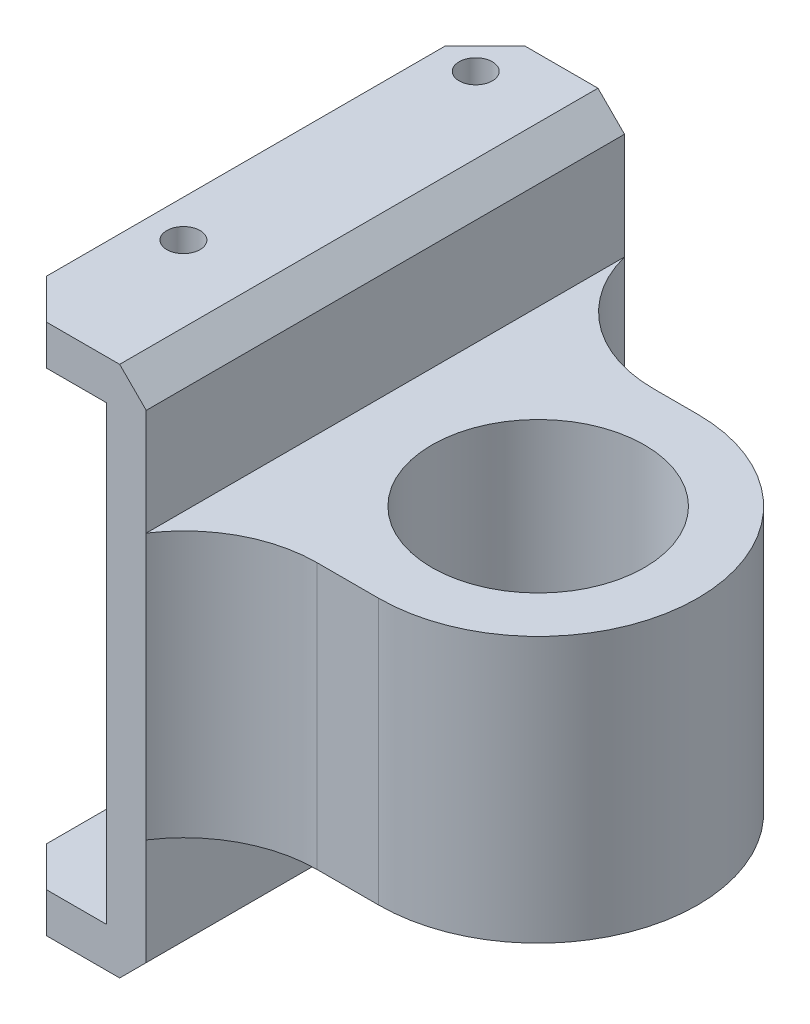
ISO-10303-21;
HEADER;
FILE_DESCRIPTION(('STEP AP214'),'2;1');
FILE_NAME('part.step','',(''),(''),'','','');
FILE_SCHEMA(('AUTOMOTIVE_DESIGN { 1 0 10303 214 1 1 1 1 }'));
ENDSEC;
DATA;
#1=APPLICATION_CONTEXT('core data for automotive mechanical design processes');
#2=APPLICATION_PROTOCOL_DEFINITION('international standard','automotive_design',2000,#1);
#3=PRODUCT_CONTEXT('',#1,'mechanical');
#4=PRODUCT('Part','Part','',(#3));
#5=PRODUCT_RELATED_PRODUCT_CATEGORY('part','',(#4));
#6=PRODUCT_DEFINITION_FORMATION('','',#4);
#7=PRODUCT_DEFINITION_CONTEXT('part definition',#1,'design');
#8=PRODUCT_DEFINITION('design','',#6,#7);
#9=PRODUCT_DEFINITION_SHAPE('','',#8);
#10=(LENGTH_UNIT() NAMED_UNIT(*) SI_UNIT(.MILLI.,.METRE.));
#11=(NAMED_UNIT(*) PLANE_ANGLE_UNIT() SI_UNIT($,.RADIAN.));
#12=(NAMED_UNIT(*) SI_UNIT($,.STERADIAN.) SOLID_ANGLE_UNIT());
#13=UNCERTAINTY_MEASURE_WITH_UNIT(LENGTH_MEASURE(1.E-05),#10,'distance_accuracy_value','');
#14=(GEOMETRIC_REPRESENTATION_CONTEXT(3) GLOBAL_UNCERTAINTY_ASSIGNED_CONTEXT((#13)) GLOBAL_UNIT_ASSIGNED_CONTEXT((#10,
#11,#12)) REPRESENTATION_CONTEXT('',''));
#15=CARTESIAN_POINT('',(0.,0.,0.));
#16=DIRECTION('',(0.,0.,1.));
#17=DIRECTION('',(1.,0.,0.));
#18=AXIS2_PLACEMENT_3D('',#15,#16,#17);
#19=CARTESIAN_POINT('',(-10.5,20.,36.));
#20=DIRECTION('',(1.,0.,0.));
#21=DIRECTION('',(0.,0.,-1.));
#22=AXIS2_PLACEMENT_3D('',#19,#20,#21);
#23=PLANE('',#22);
#24=DIRECTION('',(0.,0.,-1.));
#25=VECTOR('',#24,1.);
#26=CARTESIAN_POINT('',(-10.5,17.,36.));
#27=LINE('',#26,#25);
#28=CARTESIAN_POINT('',(-10.5,17.,33.));
#29=VERTEX_POINT('',#28);
#30=CARTESIAN_POINT('',(-10.5,17.,3.00000000000001));
#31=VERTEX_POINT('',#30);
#32=EDGE_CURVE('E229',#29,#31,#27,.T.);
#33=ORIENTED_EDGE('',*,*,#32,.F.);
#34=DIRECTION('',(0.,1.,0.));
#35=VECTOR('',#34,1.);
#36=CARTESIAN_POINT('',(-10.5,20.,33.));
#37=LINE('',#36,#35);
#38=CARTESIAN_POINT('',(-10.5,20.,33.));
#39=VERTEX_POINT('',#38);
#40=EDGE_CURVE('E263',#29,#39,#37,.T.);
#41=ORIENTED_EDGE('',*,*,#40,.T.);
#42=DIRECTION('',(0.,0.,-1.));
#43=VECTOR('',#42,1.);
#44=CARTESIAN_POINT('',(-10.5,20.,36.));
#45=LINE('',#44,#43);
#46=CARTESIAN_POINT('',(-10.5,20.,3.00000000000001));
#47=VERTEX_POINT('',#46);
#48=EDGE_CURVE('E213',#39,#47,#45,.T.);
#49=ORIENTED_EDGE('',*,*,#48,.T.);
#50=DIRECTION('',(0.,-1.,0.));
#51=VECTOR('',#50,1.);
#52=CARTESIAN_POINT('',(-10.5,20.,3.));
#53=LINE('',#52,#51);
#54=EDGE_CURVE('E260',#47,#31,#53,.T.);
#55=ORIENTED_EDGE('',*,*,#54,.T.);
#56=EDGE_LOOP('',(#33,#41,#49,#55));
#57=FACE_BOUND('',#56,.T.);
#58=ADVANCED_FACE('F32',(#57),#23,.F.);
#59=CARTESIAN_POINT('',(-10.5,17.,36.));
#60=DIRECTION('',(0.,1.,0.));
#61=DIRECTION('',(0.,0.,1.));
#62=AXIS2_PLACEMENT_3D('',#59,#60,#61);
#63=PLANE('',#62);
#64=CARTESIAN_POINT('',(-7.69999999999999,17.,25.5));
#65=DIRECTION('',(0.,1.,0.));
#66=DIRECTION('',(0.,0.,1.));
#67=AXIS2_PLACEMENT_3D('',#64,#65,#66);
#68=CIRCLE('',#67,1.25);
#69=CARTESIAN_POINT('',(-7.69999999999999,17.,26.75));
#70=VERTEX_POINT('',#69);
#71=EDGE_CURVE('E336',#70,#70,#68,.T.);
#72=ORIENTED_EDGE('',*,*,#71,.T.);
#73=EDGE_LOOP('',(#72));
#74=FACE_BOUND('',#73,.T.);
#75=CARTESIAN_POINT('',(-7.7,17.,3.5));
#76=DIRECTION('',(0.,1.,0.));
#77=DIRECTION('',(0.,0.,1.));
#78=AXIS2_PLACEMENT_3D('',#75,#76,#77);
#79=CIRCLE('',#78,1.25);
#80=CARTESIAN_POINT('',(-7.7,17.,4.75));
#81=VERTEX_POINT('',#80);
#82=EDGE_CURVE('E348',#81,#81,#79,.T.);
#83=ORIENTED_EDGE('',*,*,#82,.T.);
#84=EDGE_LOOP('',(#83));
#85=FACE_BOUND('',#84,.T.);
#86=DIRECTION('',(1.,0.,0.));
#87=VECTOR('',#86,1.);
#88=CARTESIAN_POINT('',(-10.5,17.,36.));
#89=LINE('',#88,#87);
#90=CARTESIAN_POINT('',(-7.49999999999999,17.,36.));
#91=VERTEX_POINT('',#90);
#92=CARTESIAN_POINT('',(-3.,17.,36.));
#93=VERTEX_POINT('',#92);
#94=EDGE_CURVE('E212',#91,#93,#89,.T.);
#95=ORIENTED_EDGE('',*,*,#94,.F.);
#96=DIRECTION('',(-0.707106781186546,0.,-0.707106781186549));
#97=VECTOR('',#96,1.);
#98=CARTESIAN_POINT('',(-7.49999999999999,17.,36.));
#99=LINE('',#98,#97);
#100=EDGE_CURVE('E258',#91,#29,#99,.T.);
#101=ORIENTED_EDGE('',*,*,#100,.T.);
#102=ORIENTED_EDGE('',*,*,#32,.T.);
#103=DIRECTION('',(-0.707106781186548,0.,0.707106781186547));
#104=VECTOR('',#103,1.);
#105=CARTESIAN_POINT('',(-10.5,17.,3.));
#106=LINE('',#105,#104);
#107=CARTESIAN_POINT('',(-7.49999999999999,17.,0.));
#108=VERTEX_POINT('',#107);
#109=EDGE_CURVE('E256',#31,#108,#106,.F.);
#110=ORIENTED_EDGE('',*,*,#109,.T.);
#111=DIRECTION('',(1.,0.,0.));
#112=VECTOR('',#111,1.);
#113=CARTESIAN_POINT('',(-10.5,17.,0.));
#114=LINE('',#113,#112);
#115=CARTESIAN_POINT('',(-3.,17.,0.));
#116=VERTEX_POINT('',#115);
#117=EDGE_CURVE('E351',#108,#116,#114,.T.);
#118=ORIENTED_EDGE('',*,*,#117,.T.);
#119=DIRECTION('',(0.,0.,-1.));
#120=VECTOR('',#119,1.);
#121=CARTESIAN_POINT('',(-3.,17.,36.));
#122=LINE('',#121,#120);
#123=EDGE_CURVE('E226',#93,#116,#122,.T.);
#124=ORIENTED_EDGE('',*,*,#123,.F.);
#125=EDGE_LOOP('',(#95,#101,#102,#110,#118,#124));
#126=FACE_BOUND('',#125,.T.);
#127=ADVANCED_FACE('F418',(#74,#85,#126),#63,.F.);
#128=CARTESIAN_POINT('',(-3.,17.,36.));
#129=DIRECTION('',(1.,0.,0.));
#130=DIRECTION('',(0.,1.,0.));
#131=AXIS2_PLACEMENT_3D('',#128,#129,#130);
#132=PLANE('',#131);
#133=DIRECTION('',(0.,-1.,0.));
#134=VECTOR('',#133,1.);
#135=CARTESIAN_POINT('',(-3.,17.,0.));
#136=LINE('',#135,#134);
#137=CARTESIAN_POINT('',(-2.99999999999999,-17.,0.));
#138=VERTEX_POINT('',#137);
#139=EDGE_CURVE('E364',#116,#138,#136,.T.);
#140=ORIENTED_EDGE('',*,*,#139,.T.);
#141=DIRECTION('',(0.,0.,-1.));
#142=VECTOR('',#141,1.);
#143=CARTESIAN_POINT('',(-2.99999999999999,-17.,36.));
#144=LINE('',#143,#142);
#145=CARTESIAN_POINT('',(-2.99999999999999,-17.,36.));
#146=VERTEX_POINT('',#145);
#147=EDGE_CURVE('E223',#146,#138,#144,.T.);
#148=ORIENTED_EDGE('',*,*,#147,.F.);
#149=DIRECTION('',(0.,-1.,0.));
#150=VECTOR('',#149,1.);
#151=CARTESIAN_POINT('',(-3.,17.,36.));
#152=LINE('',#151,#150);
#153=EDGE_CURVE('E353',#93,#146,#152,.T.);
#154=ORIENTED_EDGE('',*,*,#153,.F.);
#155=ORIENTED_EDGE('',*,*,#123,.T.);
#156=EDGE_LOOP('',(#140,#148,#154,#155));
#157=FACE_BOUND('',#156,.T.);
#158=ADVANCED_FACE('F394',(#157),#132,.F.);
#159=CARTESIAN_POINT('',(-10.5,-17.,36.));
#160=DIRECTION('',(0.,-1.,0.));
#161=DIRECTION('',(0.,0.,-1.));
#162=AXIS2_PLACEMENT_3D('',#159,#160,#161);
#163=PLANE('',#162);
#164=CARTESIAN_POINT('',(-7.69999999999999,-17.,25.5));
#165=DIRECTION('',(0.,-1.,0.));
#166=DIRECTION('',(0.,0.,-1.));
#167=AXIS2_PLACEMENT_3D('',#164,#165,#166);
#168=CIRCLE('',#167,1.25);
#169=CARTESIAN_POINT('',(-7.69999999999999,-17.,24.25));
#170=VERTEX_POINT('',#169);
#171=EDGE_CURVE('E331',#170,#170,#168,.T.);
#172=ORIENTED_EDGE('',*,*,#171,.T.);
#173=EDGE_LOOP('',(#172));
#174=FACE_BOUND('',#173,.T.);
#175=CARTESIAN_POINT('',(-7.7,-17.,3.5));
#176=DIRECTION('',(0.,-1.,0.));
#177=DIRECTION('',(0.,0.,-1.));
#178=AXIS2_PLACEMENT_3D('',#175,#176,#177);
#179=CIRCLE('',#178,1.25);
#180=CARTESIAN_POINT('',(-7.7,-17.,2.25));
#181=VERTEX_POINT('',#180);
#182=EDGE_CURVE('E343',#181,#181,#179,.T.);
#183=ORIENTED_EDGE('',*,*,#182,.T.);
#184=EDGE_LOOP('',(#183));
#185=FACE_BOUND('',#184,.T.);
#186=DIRECTION('',(0.,0.,-1.));
#187=VECTOR('',#186,1.);
#188=CARTESIAN_POINT('',(-10.5,-17.,36.));
#189=LINE('',#188,#187);
#190=CARTESIAN_POINT('',(-10.5,-17.,33.));
#191=VERTEX_POINT('',#190);
#192=CARTESIAN_POINT('',(-10.5,-17.,3.00000000000001));
#193=VERTEX_POINT('',#192);
#194=EDGE_CURVE('E220',#191,#193,#189,.T.);
#195=ORIENTED_EDGE('',*,*,#194,.F.);
#196=DIRECTION('',(0.707106781186546,0.,0.707106781186549));
#197=VECTOR('',#196,1.);
#198=CARTESIAN_POINT('',(-7.49999999999999,-17.,36.));
#199=LINE('',#198,#197);
#200=CARTESIAN_POINT('',(-7.49999999999999,-17.,36.));
#201=VERTEX_POINT('',#200);
#202=EDGE_CURVE('E249',#191,#201,#199,.T.);
#203=ORIENTED_EDGE('',*,*,#202,.T.);
#204=DIRECTION('',(-1.,0.,0.));
#205=VECTOR('',#204,1.);
#206=CARTESIAN_POINT('',(-10.5,-17.,36.));
#207=LINE('',#206,#205);
#208=EDGE_CURVE('E355',#146,#201,#207,.T.);
#209=ORIENTED_EDGE('',*,*,#208,.F.);
#210=ORIENTED_EDGE('',*,*,#147,.T.);
#211=DIRECTION('',(-1.,0.,0.));
#212=VECTOR('',#211,1.);
#213=CARTESIAN_POINT('',(-10.5,-17.,0.));
#214=LINE('',#213,#212);
#215=CARTESIAN_POINT('',(-7.49999999999999,-17.,0.));
#216=VERTEX_POINT('',#215);
#217=EDGE_CURVE('E207',#138,#216,#214,.T.);
#218=ORIENTED_EDGE('',*,*,#217,.T.);
#219=DIRECTION('',(0.707106781186548,0.,-0.707106781186547));
#220=VECTOR('',#219,1.);
#221=CARTESIAN_POINT('',(-10.5,-17.,3.));
#222=LINE('',#221,#220);
#223=EDGE_CURVE('E247',#216,#193,#222,.F.);
#224=ORIENTED_EDGE('',*,*,#223,.T.);
#225=EDGE_LOOP('',(#195,#203,#209,#210,#218,#224));
#226=FACE_BOUND('',#225,.T.);
#227=ADVANCED_FACE('F370',(#174,#185,#226),#163,.F.);
#228=CARTESIAN_POINT('',(-10.5,-17.,36.));
#229=DIRECTION('',(1.,0.,0.));
#230=DIRECTION('',(0.,0.,-1.));
#231=AXIS2_PLACEMENT_3D('',#228,#229,#230);
#232=PLANE('',#231);
#233=DIRECTION('',(0.,0.,-1.));
#234=VECTOR('',#233,1.);
#235=CARTESIAN_POINT('',(-10.5,-20.,36.));
#236=LINE('',#235,#234);
#237=CARTESIAN_POINT('',(-10.5,-20.,33.));
#238=VERTEX_POINT('',#237);
#239=CARTESIAN_POINT('',(-10.5,-20.,3.00000000000001));
#240=VERTEX_POINT('',#239);
#241=EDGE_CURVE('E216',#238,#240,#236,.T.);
#242=ORIENTED_EDGE('',*,*,#241,.F.);
#243=DIRECTION('',(0.,1.,0.));
#244=VECTOR('',#243,1.);
#245=CARTESIAN_POINT('',(-10.5,-17.,33.));
#246=LINE('',#245,#244);
#247=EDGE_CURVE('E245',#238,#191,#246,.T.);
#248=ORIENTED_EDGE('',*,*,#247,.T.);
#249=ORIENTED_EDGE('',*,*,#194,.T.);
#250=DIRECTION('',(0.,-1.,0.));
#251=VECTOR('',#250,1.);
#252=CARTESIAN_POINT('',(-10.5,-17.,3.));
#253=LINE('',#252,#251);
#254=EDGE_CURVE('E242',#193,#240,#253,.T.);
#255=ORIENTED_EDGE('',*,*,#254,.T.);
#256=EDGE_LOOP('',(#242,#248,#249,#255));
#257=FACE_BOUND('',#256,.T.);
#258=ADVANCED_FACE('F380',(#257),#232,.F.);
#259=CARTESIAN_POINT('',(-10.5,-20.,36.));
#260=DIRECTION('',(0.,1.,0.));
#261=DIRECTION('',(0.,0.,1.));
#262=AXIS2_PLACEMENT_3D('',#259,#260,#261);
#263=PLANE('',#262);
#264=CARTESIAN_POINT('',(-7.69999999999999,-20.,25.5));
#265=DIRECTION('',(0.,1.,0.));
#266=DIRECTION('',(0.,0.,1.));
#267=AXIS2_PLACEMENT_3D('',#264,#265,#266);
#268=CIRCLE('',#267,1.25);
#269=CARTESIAN_POINT('',(-7.69999999999999,-20.,26.75));
#270=VERTEX_POINT('',#269);
#271=EDGE_CURVE('E328',#270,#270,#268,.T.);
#272=ORIENTED_EDGE('',*,*,#271,.T.);
#273=EDGE_LOOP('',(#272));
#274=FACE_BOUND('',#273,.T.);
#275=CARTESIAN_POINT('',(-7.7,-20.,3.5));
#276=DIRECTION('',(0.,1.,0.));
#277=DIRECTION('',(0.,0.,1.));
#278=AXIS2_PLACEMENT_3D('',#275,#276,#277);
#279=CIRCLE('',#278,1.25);
#280=CARTESIAN_POINT('',(-7.7,-20.,4.75));
#281=VERTEX_POINT('',#280);
#282=EDGE_CURVE('E340',#281,#281,#279,.T.);
#283=ORIENTED_EDGE('',*,*,#282,.T.);
#284=EDGE_LOOP('',(#283));
#285=FACE_BOUND('',#284,.T.);
#286=DIRECTION('',(1.,0.,0.));
#287=VECTOR('',#286,1.);
#288=CARTESIAN_POINT('',(-10.5,-20.,0.));
#289=LINE('',#288,#287);
#290=CARTESIAN_POINT('',(-7.49999999999999,-20.,0.));
#291=VERTEX_POINT('',#290);
#292=CARTESIAN_POINT('',(-2.,-20.,0.));
#293=VERTEX_POINT('',#292);
#294=EDGE_CURVE('E205',#291,#293,#289,.T.);
#295=ORIENTED_EDGE('',*,*,#294,.T.);
#296=DIRECTION('',(0.,0.,1.));
#297=VECTOR('',#296,1.);
#298=CARTESIAN_POINT('',(-2.,-20.,36.));
#299=LINE('',#298,#297);
#300=CARTESIAN_POINT('',(-2.,-20.,36.));
#301=VERTEX_POINT('',#300);
#302=EDGE_CURVE('E278',#293,#301,#299,.T.);
#303=ORIENTED_EDGE('',*,*,#302,.T.);
#304=DIRECTION('',(1.,0.,0.));
#305=VECTOR('',#304,1.);
#306=CARTESIAN_POINT('',(-10.5,-20.,36.));
#307=LINE('',#306,#305);
#308=CARTESIAN_POINT('',(-7.49999999999999,-20.,36.));
#309=VERTEX_POINT('',#308);
#310=EDGE_CURVE('E358',#309,#301,#307,.T.);
#311=ORIENTED_EDGE('',*,*,#310,.F.);
#312=DIRECTION('',(-0.707106781186546,0.,-0.707106781186549));
#313=VECTOR('',#312,1.);
#314=CARTESIAN_POINT('',(-7.49999999999999,-20.,36.));
#315=LINE('',#314,#313);
#316=EDGE_CURVE('E240',#309,#238,#315,.T.);
#317=ORIENTED_EDGE('',*,*,#316,.T.);
#318=ORIENTED_EDGE('',*,*,#241,.T.);
#319=DIRECTION('',(-0.707106781186548,0.,0.707106781186547));
#320=VECTOR('',#319,1.);
#321=CARTESIAN_POINT('',(-10.5,-20.,3.));
#322=LINE('',#321,#320);
#323=EDGE_CURVE('E238',#240,#291,#322,.F.);
#324=ORIENTED_EDGE('',*,*,#323,.T.);
#325=EDGE_LOOP('',(#295,#303,#311,#317,#318,#324));
#326=FACE_BOUND('',#325,.T.);
#327=ADVANCED_FACE('F383',(#274,#285,#326),#263,.F.);
#328=CARTESIAN_POINT('',(-10.5,20.,36.));
#329=DIRECTION('',(0.,-1.,0.));
#330=DIRECTION('',(0.,0.,-1.));
#331=AXIS2_PLACEMENT_3D('',#328,#329,#330);
#332=PLANE('',#331);
#333=CARTESIAN_POINT('',(-7.69999999999999,20.,25.5));
#334=DIRECTION('',(0.,1.,0.));
#335=DIRECTION('',(0.,0.,1.));
#336=AXIS2_PLACEMENT_3D('',#333,#334,#335);
#337=CIRCLE('',#336,1.25);
#338=CARTESIAN_POINT('',(-7.69999999999999,20.,26.75));
#339=VERTEX_POINT('',#338);
#340=EDGE_CURVE('E326',#339,#339,#337,.T.);
#341=ORIENTED_EDGE('',*,*,#340,.F.);
#342=EDGE_LOOP('',(#341));
#343=FACE_BOUND('',#342,.T.);
#344=CARTESIAN_POINT('',(-7.7,20.,3.5));
#345=DIRECTION('',(0.,1.,0.));
#346=DIRECTION('',(0.,0.,1.));
#347=AXIS2_PLACEMENT_3D('',#344,#345,#346);
#348=CIRCLE('',#347,1.25);
#349=CARTESIAN_POINT('',(-7.7,20.,4.75));
#350=VERTEX_POINT('',#349);
#351=EDGE_CURVE('E339',#350,#350,#348,.T.);
#352=ORIENTED_EDGE('',*,*,#351,.F.);
#353=EDGE_LOOP('',(#352));
#354=FACE_BOUND('',#353,.T.);
#355=DIRECTION('',(-1.,0.,0.));
#356=VECTOR('',#355,1.);
#357=CARTESIAN_POINT('',(-10.5,20.,36.));
#358=LINE('',#357,#356);
#359=CARTESIAN_POINT('',(-2.00000000000001,20.,36.));
#360=VERTEX_POINT('',#359);
#361=CARTESIAN_POINT('',(-7.49999999999999,20.,36.));
#362=VERTEX_POINT('',#361);
#363=EDGE_CURVE('E217',#360,#362,#358,.T.);
#364=ORIENTED_EDGE('',*,*,#363,.F.);
#365=DIRECTION('',(0.,0.,-1.));
#366=VECTOR('',#365,1.);
#367=CARTESIAN_POINT('',(-2.00000000000001,20.,36.));
#368=LINE('',#367,#366);
#369=CARTESIAN_POINT('',(-2.00000000000001,20.,0.));
#370=VERTEX_POINT('',#369);
#371=EDGE_CURVE('E11',#360,#370,#368,.T.);
#372=ORIENTED_EDGE('',*,*,#371,.T.);
#373=DIRECTION('',(-1.,0.,0.));
#374=VECTOR('',#373,1.);
#375=CARTESIAN_POINT('',(-10.5,20.,0.));
#376=LINE('',#375,#374);
#377=CARTESIAN_POINT('',(-7.49999999999999,20.,0.));
#378=VERTEX_POINT('',#377);
#379=EDGE_CURVE('E178',#370,#378,#376,.T.);
#380=ORIENTED_EDGE('',*,*,#379,.T.);
#381=DIRECTION('',(0.707106781186548,0.,-0.707106781186547));
#382=VECTOR('',#381,1.);
#383=CARTESIAN_POINT('',(-10.5,20.,3.));
#384=LINE('',#383,#382);
#385=EDGE_CURVE('E265',#378,#47,#384,.F.);
#386=ORIENTED_EDGE('',*,*,#385,.T.);
#387=ORIENTED_EDGE('',*,*,#48,.F.);
#388=DIRECTION('',(0.707106781186546,0.,0.707106781186549));
#389=VECTOR('',#388,1.);
#390=CARTESIAN_POINT('',(-7.49999999999999,20.,36.));
#391=LINE('',#390,#389);
#392=EDGE_CURVE('E267',#39,#362,#391,.T.);
#393=ORIENTED_EDGE('',*,*,#392,.T.);
#394=EDGE_LOOP('',(#364,#372,#380,#386,#387,#393));
#395=FACE_BOUND('',#394,.T.);
#396=ADVANCED_FACE('F403',(#343,#354,#395),#332,.F.);
#397=CARTESIAN_POINT('',(0.,0.,36.));
#398=DIRECTION('',(0.,0.,1.));
#399=DIRECTION('',(1.,0.,0.));
#400=AXIS2_PLACEMENT_3D('',#397,#398,#399);
#401=PLANE('',#400);
#402=ORIENTED_EDGE('',*,*,#310,.T.);
#403=DIRECTION('',(-0.707106781186545,-0.70710678118655,0.));
#404=VECTOR('',#403,1.);
#405=CARTESIAN_POINT('',(8.99999999999999,-8.99999999999993,36.));
#406=LINE('',#405,#404);
#407=CARTESIAN_POINT('',(0.,-18.,36.));
#408=VERTEX_POINT('',#407);
#409=EDGE_CURVE('E283',#301,#408,#406,.F.);
#410=ORIENTED_EDGE('',*,*,#409,.T.);
#411=DIRECTION('',(0.,1.,0.));
#412=VECTOR('',#411,1.);
#413=CARTESIAN_POINT('',(0.,20.,36.));
#414=LINE('',#413,#412);
#415=CARTESIAN_POINT('',(0.,-10.,36.));
#416=VERTEX_POINT('',#415);
#417=EDGE_CURVE('E360',#408,#416,#414,.T.);
#418=ORIENTED_EDGE('',*,*,#417,.T.);
#419=CARTESIAN_POINT('',(0.,10.,36.));
#420=VERTEX_POINT('',#419);
#421=EDGE_CURVE('E300',#416,#420,#414,.T.);
#422=ORIENTED_EDGE('',*,*,#421,.T.);
#423=DIRECTION('',(0.,-1.,0.));
#424=VECTOR('',#423,1.);
#425=CARTESIAN_POINT('',(0.,20.,36.));
#426=LINE('',#425,#424);
#427=CARTESIAN_POINT('',(0.,18.,36.));
#428=VERTEX_POINT('',#427);
#429=EDGE_CURVE('E294',#428,#420,#426,.T.);
#430=ORIENTED_EDGE('',*,*,#429,.F.);
#431=DIRECTION('',(0.707106781186549,-0.707106781186546,0.));
#432=VECTOR('',#431,1.);
#433=CARTESIAN_POINT('',(9.,9.00000000000003,36.));
#434=LINE('',#433,#432);
#435=EDGE_CURVE('E281',#428,#360,#434,.F.);
#436=ORIENTED_EDGE('',*,*,#435,.T.);
#437=ORIENTED_EDGE('',*,*,#363,.T.);
#438=DIRECTION('',(0.,-1.,0.));
#439=VECTOR('',#438,1.);
#440=CARTESIAN_POINT('',(-7.49999999999999,17.,36.));
#441=LINE('',#440,#439);
#442=EDGE_CURVE('E232',#362,#91,#441,.T.);
#443=ORIENTED_EDGE('',*,*,#442,.T.);
#444=ORIENTED_EDGE('',*,*,#94,.T.);
#445=ORIENTED_EDGE('',*,*,#153,.T.);
#446=ORIENTED_EDGE('',*,*,#208,.T.);
#447=DIRECTION('',(0.,-1.,0.));
#448=VECTOR('',#447,1.);
#449=CARTESIAN_POINT('',(-7.49999999999999,-20.,36.));
#450=LINE('',#449,#448);
#451=EDGE_CURVE('E235',#201,#309,#450,.T.);
#452=ORIENTED_EDGE('',*,*,#451,.T.);
#453=EDGE_LOOP('',(#402,#410,#418,#422,#430,#436,#437,#443,#444,#445,#446,#452));
#454=FACE_BOUND('',#453,.T.);
#455=ADVANCED_FACE('F299',(#454),#401,.T.);
#456=CARTESIAN_POINT('',(0.,0.,0.));
#457=DIRECTION('',(0.,0.,1.));
#458=DIRECTION('',(1.,0.,0.));
#459=AXIS2_PLACEMENT_3D('',#456,#457,#458);
#460=PLANE('',#459);
#461=DIRECTION('',(0.,1.,0.));
#462=VECTOR('',#461,1.);
#463=CARTESIAN_POINT('',(0.,20.,0.));
#464=LINE('',#463,#462);
#465=CARTESIAN_POINT('',(0.,-18.,0.));
#466=VERTEX_POINT('',#465);
#467=CARTESIAN_POINT('',(0.,-10.,0.));
#468=VERTEX_POINT('',#467);
#469=EDGE_CURVE('E168',#466,#468,#464,.T.);
#470=ORIENTED_EDGE('',*,*,#469,.F.);
#471=DIRECTION('',(0.707106781186545,0.70710678118655,0.));
#472=VECTOR('',#471,1.);
#473=CARTESIAN_POINT('',(-2.,-20.,0.));
#474=LINE('',#473,#472);
#475=EDGE_CURVE('E287',#466,#293,#474,.F.);
#476=ORIENTED_EDGE('',*,*,#475,.T.);
#477=ORIENTED_EDGE('',*,*,#294,.F.);
#478=DIRECTION('',(0.,1.,0.));
#479=VECTOR('',#478,1.);
#480=CARTESIAN_POINT('',(-7.49999999999999,0.,0.));
#481=LINE('',#480,#479);
#482=EDGE_CURVE('E254',#291,#216,#481,.T.);
#483=ORIENTED_EDGE('',*,*,#482,.T.);
#484=ORIENTED_EDGE('',*,*,#217,.F.);
#485=ORIENTED_EDGE('',*,*,#139,.F.);
#486=ORIENTED_EDGE('',*,*,#117,.F.);
#487=DIRECTION('',(0.,1.,0.));
#488=VECTOR('',#487,1.);
#489=CARTESIAN_POINT('',(-7.49999999999999,0.,0.));
#490=LINE('',#489,#488);
#491=EDGE_CURVE('E251',#108,#378,#490,.T.);
#492=ORIENTED_EDGE('',*,*,#491,.T.);
#493=ORIENTED_EDGE('',*,*,#379,.F.);
#494=DIRECTION('',(-0.707106781186549,0.707106781186546,0.));
#495=VECTOR('',#494,1.);
#496=CARTESIAN_POINT('',(0.,18.,0.));
#497=LINE('',#496,#495);
#498=CARTESIAN_POINT('',(0.,18.,0.));
#499=VERTEX_POINT('',#498);
#500=EDGE_CURVE('E47',#370,#499,#497,.F.);
#501=ORIENTED_EDGE('',*,*,#500,.T.);
#502=DIRECTION('',(0.,-1.,0.));
#503=VECTOR('',#502,1.);
#504=CARTESIAN_POINT('',(0.,20.,0.));
#505=LINE('',#504,#503);
#506=CARTESIAN_POINT('',(0.,10.,0.));
#507=VERTEX_POINT('',#506);
#508=EDGE_CURVE('E204',#499,#507,#505,.T.);
#509=ORIENTED_EDGE('',*,*,#508,.T.);
#510=EDGE_CURVE('E179',#468,#507,#464,.T.);
#511=ORIENTED_EDGE('',*,*,#510,.F.);
#512=EDGE_LOOP('',(#470,#476,#477,#483,#484,#485,#486,#492,#493,#501,#509,#511));
#513=FACE_BOUND('',#512,.T.);
#514=ADVANCED_FACE('F203',(#513),#460,.F.);
#515=CARTESIAN_POINT('',(-7.7,-20.,3.5));
#516=DIRECTION('',(0.,1.,0.));
#517=DIRECTION('',(0.,0.,1.));
#518=AXIS2_PLACEMENT_3D('',#515,#516,#517);
#519=CYLINDRICAL_SURFACE('',#518,1.25);
#520=ORIENTED_EDGE('',*,*,#351,.T.);
#521=EDGE_LOOP('',(#520));
#522=FACE_BOUND('',#521,.T.);
#523=ORIENTED_EDGE('',*,*,#82,.F.);
#524=EDGE_LOOP('',(#523));
#525=FACE_BOUND('',#524,.T.);
#526=ADVANCED_FACE('F483',(#522,#525),#519,.F.);
#527=ORIENTED_EDGE('',*,*,#282,.F.);
#528=EDGE_LOOP('',(#527));
#529=FACE_BOUND('',#528,.T.);
#530=ORIENTED_EDGE('',*,*,#182,.F.);
#531=EDGE_LOOP('',(#530));
#532=FACE_BOUND('',#531,.T.);
#533=ADVANCED_FACE('F481',(#529,#532),#519,.F.);
#534=CARTESIAN_POINT('',(-7.69999999999999,-20.,25.5));
#535=DIRECTION('',(0.,1.,0.));
#536=DIRECTION('',(0.,0.,1.));
#537=AXIS2_PLACEMENT_3D('',#534,#535,#536);
#538=CYLINDRICAL_SURFACE('',#537,1.25);
#539=ORIENTED_EDGE('',*,*,#340,.T.);
#540=EDGE_LOOP('',(#539));
#541=FACE_BOUND('',#540,.T.);
#542=ORIENTED_EDGE('',*,*,#71,.F.);
#543=EDGE_LOOP('',(#542));
#544=FACE_BOUND('',#543,.T.);
#545=ADVANCED_FACE('F478',(#541,#544),#538,.F.);
#546=ORIENTED_EDGE('',*,*,#271,.F.);
#547=EDGE_LOOP('',(#546));
#548=FACE_BOUND('',#547,.T.);
#549=ORIENTED_EDGE('',*,*,#171,.F.);
#550=EDGE_LOOP('',(#549));
#551=FACE_BOUND('',#550,.T.);
#552=ADVANCED_FACE('F429',(#548,#551),#538,.F.);
#553=CARTESIAN_POINT('',(-7.49999999999999,0.,36.));
#554=DIRECTION('',(-0.707106781186549,0.,0.707106781186546));
#555=DIRECTION('',(0.,1.,0.));
#556=AXIS2_PLACEMENT_3D('',#553,#554,#555);
#557=PLANE('',#556);
#558=ORIENTED_EDGE('',*,*,#202,.F.);
#559=ORIENTED_EDGE('',*,*,#247,.F.);
#560=ORIENTED_EDGE('',*,*,#316,.F.);
#561=ORIENTED_EDGE('',*,*,#451,.F.);
#562=EDGE_LOOP('',(#558,#559,#560,#561));
#563=FACE_BOUND('',#562,.T.);
#564=ADVANCED_FACE('F389',(#563),#557,.T.);
#565=CARTESIAN_POINT('',(-10.5,-17.,3.));
#566=DIRECTION('',(0.707106781186547,0.,0.707106781186548));
#567=DIRECTION('',(0.,-1.,0.));
#568=AXIS2_PLACEMENT_3D('',#565,#566,#567);
#569=PLANE('',#568);
#570=ORIENTED_EDGE('',*,*,#223,.F.);
#571=ORIENTED_EDGE('',*,*,#482,.F.);
#572=ORIENTED_EDGE('',*,*,#323,.F.);
#573=ORIENTED_EDGE('',*,*,#254,.F.);
#574=EDGE_LOOP('',(#570,#571,#572,#573));
#575=FACE_BOUND('',#574,.T.);
#576=ADVANCED_FACE('F377',(#575),#569,.F.);
#577=CARTESIAN_POINT('',(-7.49999999999999,0.,36.));
#578=DIRECTION('',(-0.707106781186549,0.,0.707106781186546));
#579=DIRECTION('',(0.,1.,0.));
#580=AXIS2_PLACEMENT_3D('',#577,#578,#579);
#581=PLANE('',#580);
#582=ORIENTED_EDGE('',*,*,#392,.F.);
#583=ORIENTED_EDGE('',*,*,#40,.F.);
#584=ORIENTED_EDGE('',*,*,#100,.F.);
#585=ORIENTED_EDGE('',*,*,#442,.F.);
#586=EDGE_LOOP('',(#582,#583,#584,#585));
#587=FACE_BOUND('',#586,.T.);
#588=ADVANCED_FACE('F409',(#587),#581,.T.);
#589=CARTESIAN_POINT('',(-10.5,20.,3.));
#590=DIRECTION('',(0.707106781186547,0.,0.707106781186548));
#591=DIRECTION('',(0.,-1.,0.));
#592=AXIS2_PLACEMENT_3D('',#589,#590,#591);
#593=PLANE('',#592);
#594=ORIENTED_EDGE('',*,*,#385,.F.);
#595=ORIENTED_EDGE('',*,*,#491,.F.);
#596=ORIENTED_EDGE('',*,*,#109,.F.);
#597=ORIENTED_EDGE('',*,*,#54,.F.);
#598=EDGE_LOOP('',(#594,#595,#596,#597));
#599=FACE_BOUND('',#598,.T.);
#600=ADVANCED_FACE('F400',(#599),#593,.F.);
#601=CARTESIAN_POINT('',(13.,-20.,19.5));
#602=DIRECTION('',(0.,1.,0.));
#603=DIRECTION('',(0.,0.,1.));
#604=AXIS2_PLACEMENT_3D('',#601,#602,#603);
#605=CYLINDRICAL_SURFACE('',#604,12.);
#606=CARTESIAN_POINT('',(13.,-10.,19.5));
#607=DIRECTION('',(0.,1.,0.));
#608=DIRECTION('',(-1.,0.,0.));
#609=AXIS2_PLACEMENT_3D('',#606,#607,#608);
#610=CIRCLE('',#609,12.);
#611=CARTESIAN_POINT('',(13.,-10.,7.5));
#612=VERTEX_POINT('',#611);
#613=CARTESIAN_POINT('',(13.,-10.,31.5));
#614=VERTEX_POINT('',#613);
#615=EDGE_CURVE('E458',#612,#614,#610,.F.);
#616=ORIENTED_EDGE('',*,*,#615,.F.);
#617=DIRECTION('',(0.,1.,0.));
#618=VECTOR('',#617,1.);
#619=CARTESIAN_POINT('',(13.,-20.,7.5));
#620=LINE('',#619,#618);
#621=CARTESIAN_POINT('',(13.,10.,7.5));
#622=VERTEX_POINT('',#621);
#623=EDGE_CURVE('E323',#612,#622,#620,.T.);
#624=ORIENTED_EDGE('',*,*,#623,.T.);
#625=CARTESIAN_POINT('',(13.,10.,19.5));
#626=DIRECTION('',(0.,-1.,0.));
#627=DIRECTION('',(1.,0.,0.));
#628=AXIS2_PLACEMENT_3D('',#625,#626,#627);
#629=CIRCLE('',#628,12.);
#630=CARTESIAN_POINT('',(13.,10.,31.5));
#631=VERTEX_POINT('',#630);
#632=EDGE_CURVE('E312',#631,#622,#629,.F.);
#633=ORIENTED_EDGE('',*,*,#632,.F.);
#634=DIRECTION('',(0.,1.,0.));
#635=VECTOR('',#634,1.);
#636=CARTESIAN_POINT('',(13.,-20.,31.5));
#637=LINE('',#636,#635);
#638=EDGE_CURVE('E324',#614,#631,#637,.T.);
#639=ORIENTED_EDGE('',*,*,#638,.F.);
#640=EDGE_LOOP('',(#616,#624,#633,#639));
#641=FACE_BOUND('',#640,.T.);
#642=ADVANCED_FACE('F436',(#641),#605,.T.);
#643=CARTESIAN_POINT('',(13.,-20.,31.5));
#644=DIRECTION('',(0.,0.,1.));
#645=DIRECTION('',(1.,0.,0.));
#646=AXIS2_PLACEMENT_3D('',#643,#644,#645);
#647=PLANE('',#646);
#648=DIRECTION('',(-1.,0.,0.));
#649=VECTOR('',#648,1.);
#650=CARTESIAN_POINT('',(13.,-10.,31.5));
#651=LINE('',#650,#649);
#652=CARTESIAN_POINT('',(8.35164654424504,-10.,31.5));
#653=VERTEX_POINT('',#652);
#654=EDGE_CURVE('E191',#614,#653,#651,.T.);
#655=ORIENTED_EDGE('',*,*,#654,.F.);
#656=ORIENTED_EDGE('',*,*,#638,.T.);
#657=DIRECTION('',(1.,0.,0.));
#658=VECTOR('',#657,1.);
#659=CARTESIAN_POINT('',(13.,10.,31.5));
#660=LINE('',#659,#658);
#661=CARTESIAN_POINT('',(8.35164654424504,10.,31.5));
#662=VERTEX_POINT('',#661);
#663=EDGE_CURVE('E309',#662,#631,#660,.T.);
#664=ORIENTED_EDGE('',*,*,#663,.F.);
#665=DIRECTION('',(0.,-1.,0.));
#666=VECTOR('',#665,1.);
#667=CARTESIAN_POINT('',(8.35164654424504,-20.,31.5));
#668=LINE('',#667,#666);
#669=EDGE_CURVE('E271',#662,#653,#668,.T.);
#670=ORIENTED_EDGE('',*,*,#669,.T.);
#671=EDGE_LOOP('',(#655,#656,#664,#670));
#672=FACE_BOUND('',#671,.T.);
#673=ADVANCED_FACE('F455',(#672),#647,.T.);
#674=CARTESIAN_POINT('',(13.,-20.,7.5));
#675=DIRECTION('',(0.,0.,-1.));
#676=DIRECTION('',(-1.,0.,0.));
#677=AXIS2_PLACEMENT_3D('',#674,#675,#676);
#678=PLANE('',#677);
#679=DIRECTION('',(1.,0.,0.));
#680=VECTOR('',#679,1.);
#681=CARTESIAN_POINT('',(13.,-10.,7.5));
#682=LINE('',#681,#680);
#683=CARTESIAN_POINT('',(9.68245836551855,-10.,7.5));
#684=VERTEX_POINT('',#683);
#685=EDGE_CURVE('E201',#684,#612,#682,.T.);
#686=ORIENTED_EDGE('',*,*,#685,.F.);
#687=DIRECTION('',(0.,-1.,0.));
#688=VECTOR('',#687,1.);
#689=CARTESIAN_POINT('',(9.68245836551855,20.,7.5));
#690=LINE('',#689,#688);
#691=CARTESIAN_POINT('',(9.68245836551855,10.,7.5));
#692=VERTEX_POINT('',#691);
#693=EDGE_CURVE('E199',#684,#692,#690,.F.);
#694=ORIENTED_EDGE('',*,*,#693,.T.);
#695=DIRECTION('',(-1.,0.,0.));
#696=VECTOR('',#695,1.);
#697=CARTESIAN_POINT('',(13.,10.,7.5));
#698=LINE('',#697,#696);
#699=EDGE_CURVE('E315',#622,#692,#698,.T.);
#700=ORIENTED_EDGE('',*,*,#699,.F.);
#701=ORIENTED_EDGE('',*,*,#623,.F.);
#702=EDGE_LOOP('',(#686,#694,#700,#701));
#703=FACE_BOUND('',#702,.T.);
#704=ADVANCED_FACE('F462',(#703),#678,.T.);
#705=CARTESIAN_POINT('',(13.,-20.,19.5));
#706=DIRECTION('',(0.,1.,0.));
#707=DIRECTION('',(0.,0.,1.));
#708=AXIS2_PLACEMENT_3D('',#705,#706,#707);
#709=CYLINDRICAL_SURFACE('',#708,8.);
#710=CARTESIAN_POINT('',(13.,-10.,19.5));
#711=DIRECTION('',(0.,1.,0.));
#712=DIRECTION('',(-1.,0.,0.));
#713=AXIS2_PLACEMENT_3D('',#710,#711,#712);
#714=CIRCLE('',#713,8.);
#715=CARTESIAN_POINT('',(5.,-10.,19.5));
#716=VERTEX_POINT('',#715);
#717=EDGE_CURVE('E200',#716,#716,#714,.F.);
#718=ORIENTED_EDGE('',*,*,#717,.T.);
#719=EDGE_LOOP('',(#718));
#720=FACE_BOUND('',#719,.T.);
#721=CARTESIAN_POINT('',(13.,10.,19.5));
#722=DIRECTION('',(0.,-1.,0.));
#723=DIRECTION('',(1.,0.,0.));
#724=AXIS2_PLACEMENT_3D('',#721,#722,#723);
#725=CIRCLE('',#724,8.);
#726=CARTESIAN_POINT('',(21.,10.,19.5));
#727=VERTEX_POINT('',#726);
#728=EDGE_CURVE('E320',#727,#727,#725,.F.);
#729=ORIENTED_EDGE('',*,*,#728,.T.);
#730=EDGE_LOOP('',(#729));
#731=FACE_BOUND('',#730,.T.);
#732=ADVANCED_FACE('F440',(#720,#731),#709,.F.);
#733=CARTESIAN_POINT('',(9.68245836551855,20.,-2.5));
#734=DIRECTION('',(0.,1.,0.));
#735=DIRECTION('',(0.,0.,1.));
#736=AXIS2_PLACEMENT_3D('',#733,#734,#735);
#737=CYLINDRICAL_SURFACE('',#736,10.);
#738=ORIENTED_EDGE('',*,*,#693,.F.);
#739=CARTESIAN_POINT('',(9.68245836551855,-10.,-2.5));
#740=DIRECTION('',(0.,1.,0.));
#741=DIRECTION('',(-1.,0.,0.));
#742=AXIS2_PLACEMENT_3D('',#739,#740,#741);
#743=CIRCLE('',#742,10.);
#744=EDGE_CURVE('E186',#684,#468,#743,.F.);
#745=ORIENTED_EDGE('',*,*,#744,.T.);
#746=ORIENTED_EDGE('',*,*,#510,.T.);
#747=CARTESIAN_POINT('',(9.68245836551855,10.,-2.5));
#748=DIRECTION('',(0.,-1.,0.));
#749=DIRECTION('',(1.,0.,0.));
#750=AXIS2_PLACEMENT_3D('',#747,#748,#749);
#751=CIRCLE('',#750,10.);
#752=EDGE_CURVE('E318',#507,#692,#751,.F.);
#753=ORIENTED_EDGE('',*,*,#752,.T.);
#754=EDGE_LOOP('',(#738,#745,#746,#753));
#755=FACE_BOUND('',#754,.T.);
#756=ADVANCED_FACE('F196',(#755),#737,.F.);
#757=CARTESIAN_POINT('',(8.35164654424504,20.,41.5));
#758=DIRECTION('',(0.,1.,0.));
#759=DIRECTION('',(0.,0.,1.));
#760=AXIS2_PLACEMENT_3D('',#757,#758,#759);
#761=CYLINDRICAL_SURFACE('',#760,10.);
#762=ORIENTED_EDGE('',*,*,#421,.F.);
#763=CARTESIAN_POINT('',(8.35164654424504,-10.,41.5));
#764=DIRECTION('',(0.,1.,0.));
#765=DIRECTION('',(-1.,0.,0.));
#766=AXIS2_PLACEMENT_3D('',#763,#764,#765);
#767=CIRCLE('',#766,10.);
#768=EDGE_CURVE('E189',#416,#653,#767,.F.);
#769=ORIENTED_EDGE('',*,*,#768,.T.);
#770=ORIENTED_EDGE('',*,*,#669,.F.);
#771=CARTESIAN_POINT('',(8.35164654424504,10.,41.5));
#772=DIRECTION('',(0.,-1.,0.));
#773=DIRECTION('',(1.,0.,0.));
#774=AXIS2_PLACEMENT_3D('',#771,#772,#773);
#775=CIRCLE('',#774,10.);
#776=EDGE_CURVE('E274',#662,#420,#775,.F.);
#777=ORIENTED_EDGE('',*,*,#776,.T.);
#778=EDGE_LOOP('',(#762,#769,#770,#777));
#779=FACE_BOUND('',#778,.T.);
#780=ADVANCED_FACE('F439',(#779),#761,.F.);
#781=CARTESIAN_POINT('',(0.,10.,0.));
#782=DIRECTION('',(0.,-1.,0.));
#783=DIRECTION('',(1.,0.,0.));
#784=AXIS2_PLACEMENT_3D('',#781,#782,#783);
#785=PLANE('',#784);
#786=DIRECTION('',(0.,0.,1.));
#787=VECTOR('',#786,1.);
#788=CARTESIAN_POINT('',(0.,10.,0.));
#789=LINE('',#788,#787);
#790=EDGE_CURVE('E303',#507,#420,#789,.T.);
#791=ORIENTED_EDGE('',*,*,#790,.T.);
#792=ORIENTED_EDGE('',*,*,#776,.F.);
#793=ORIENTED_EDGE('',*,*,#663,.T.);
#794=ORIENTED_EDGE('',*,*,#632,.T.);
#795=ORIENTED_EDGE('',*,*,#699,.T.);
#796=ORIENTED_EDGE('',*,*,#752,.F.);
#797=EDGE_LOOP('',(#791,#792,#793,#794,#795,#796));
#798=FACE_BOUND('',#797,.T.);
#799=ORIENTED_EDGE('',*,*,#728,.F.);
#800=EDGE_LOOP('',(#799));
#801=FACE_BOUND('',#800,.T.);
#802=ADVANCED_FACE('F442',(#798,#801),#785,.F.);
#803=CARTESIAN_POINT('',(0.,20.,0.));
#804=DIRECTION('',(-1.,0.,0.));
#805=DIRECTION('',(0.,-1.,0.));
#806=AXIS2_PLACEMENT_3D('',#803,#804,#805);
#807=PLANE('',#806);
#808=ORIENTED_EDGE('',*,*,#508,.F.);
#809=DIRECTION('',(0.,0.,1.));
#810=VECTOR('',#809,1.);
#811=CARTESIAN_POINT('',(0.,18.,0.));
#812=LINE('',#811,#810);
#813=EDGE_CURVE('E40',#499,#428,#812,.T.);
#814=ORIENTED_EDGE('',*,*,#813,.T.);
#815=ORIENTED_EDGE('',*,*,#429,.T.);
#816=ORIENTED_EDGE('',*,*,#790,.F.);
#817=EDGE_LOOP('',(#808,#814,#815,#816));
#818=FACE_BOUND('',#817,.T.);
#819=ADVANCED_FACE('F292',(#818),#807,.F.);
#820=CARTESIAN_POINT('',(0.,-10.,0.));
#821=DIRECTION('',(0.,1.,0.));
#822=DIRECTION('',(-1.,0.,0.));
#823=AXIS2_PLACEMENT_3D('',#820,#821,#822);
#824=PLANE('',#823);
#825=ORIENTED_EDGE('',*,*,#685,.T.);
#826=ORIENTED_EDGE('',*,*,#615,.T.);
#827=ORIENTED_EDGE('',*,*,#654,.T.);
#828=ORIENTED_EDGE('',*,*,#768,.F.);
#829=DIRECTION('',(0.,0.,1.));
#830=VECTOR('',#829,1.);
#831=CARTESIAN_POINT('',(0.,-10.,0.));
#832=LINE('',#831,#830);
#833=EDGE_CURVE('E172',#468,#416,#832,.T.);
#834=ORIENTED_EDGE('',*,*,#833,.F.);
#835=ORIENTED_EDGE('',*,*,#744,.F.);
#836=EDGE_LOOP('',(#825,#826,#827,#828,#834,#835));
#837=FACE_BOUND('',#836,.T.);
#838=ORIENTED_EDGE('',*,*,#717,.F.);
#839=EDGE_LOOP('',(#838));
#840=FACE_BOUND('',#839,.T.);
#841=ADVANCED_FACE('F184',(#837,#840),#824,.F.);
#842=CARTESIAN_POINT('',(0.,-20.,0.));
#843=DIRECTION('',(-1.,0.,0.));
#844=DIRECTION('',(0.,-1.,0.));
#845=AXIS2_PLACEMENT_3D('',#842,#843,#844);
#846=PLANE('',#845);
#847=ORIENTED_EDGE('',*,*,#417,.F.);
#848=DIRECTION('',(0.,0.,-1.));
#849=VECTOR('',#848,1.);
#850=CARTESIAN_POINT('',(0.,-18.,0.));
#851=LINE('',#850,#849);
#852=EDGE_CURVE('E175',#408,#466,#851,.T.);
#853=ORIENTED_EDGE('',*,*,#852,.T.);
#854=ORIENTED_EDGE('',*,*,#469,.T.);
#855=ORIENTED_EDGE('',*,*,#833,.T.);
#856=EDGE_LOOP('',(#847,#853,#854,#855));
#857=FACE_BOUND('',#856,.T.);
#858=ADVANCED_FACE('F171',(#857),#846,.F.);
#859=CARTESIAN_POINT('',(-2.,-20.,36.));
#860=DIRECTION('',(-0.70710678118655,0.707106781186545,0.));
#861=DIRECTION('',(0.,0.,1.));
#862=AXIS2_PLACEMENT_3D('',#859,#860,#861);
#863=PLANE('',#862);
#864=ORIENTED_EDGE('',*,*,#475,.F.);
#865=ORIENTED_EDGE('',*,*,#852,.F.);
#866=ORIENTED_EDGE('',*,*,#409,.F.);
#867=ORIENTED_EDGE('',*,*,#302,.F.);
#868=EDGE_LOOP('',(#864,#865,#866,#867));
#869=FACE_BOUND('',#868,.T.);
#870=ADVANCED_FACE('F412',(#869),#863,.F.);
#871=CARTESIAN_POINT('',(0.,18.,0.));
#872=DIRECTION('',(-0.707106781186546,-0.707106781186549,0.));
#873=DIRECTION('',(0.,0.,1.));
#874=AXIS2_PLACEMENT_3D('',#871,#872,#873);
#875=PLANE('',#874);
#876=ORIENTED_EDGE('',*,*,#500,.F.);
#877=ORIENTED_EDGE('',*,*,#371,.F.);
#878=ORIENTED_EDGE('',*,*,#435,.F.);
#879=ORIENTED_EDGE('',*,*,#813,.F.);
#880=EDGE_LOOP('',(#876,#877,#878,#879));
#881=FACE_BOUND('',#880,.T.);
#882=ADVANCED_FACE('F34',(#881),#875,.F.);
#883=CLOSED_SHELL('',(#58,#127,#158,#227,#258,#327,#396,#455,#514,#526,#533,#545,#552,#564,#576,
#588,#600,#642,#673,#704,#732,#756,#780,#802,#819,#841,#858,#870,#882));
#884=MANIFOLD_SOLID_BREP('B2',#883);
#885=ADVANCED_BREP_SHAPE_REPRESENTATION('',(#18,#884),#14);
#886=SHAPE_DEFINITION_REPRESENTATION(#9,#885);
ENDSEC;
END-ISO-10303-21;
